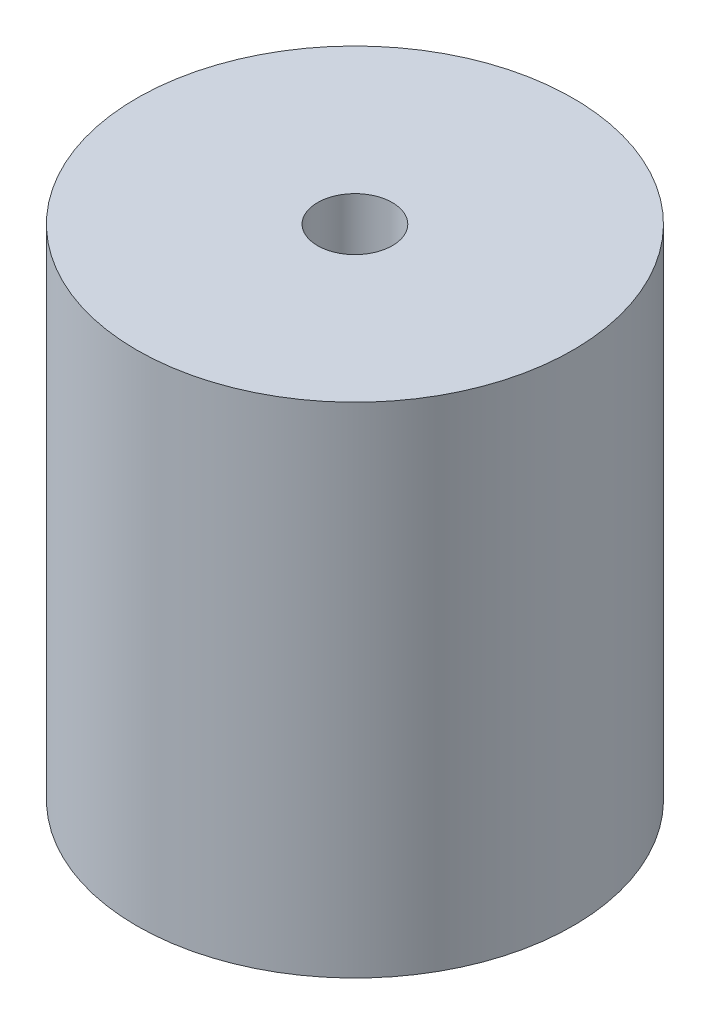
ISO-10303-21;
HEADER;
FILE_DESCRIPTION(('STEP AP214'),'2;1');
FILE_NAME('part.step','',(''),(''),'','','');
FILE_SCHEMA(('AUTOMOTIVE_DESIGN { 1 0 10303 214 1 1 1 1 }'));
ENDSEC;
DATA;
#1=APPLICATION_CONTEXT('core data for automotive mechanical design processes');
#2=APPLICATION_PROTOCOL_DEFINITION('international standard','automotive_design',2000,#1);
#3=PRODUCT_CONTEXT('',#1,'mechanical');
#4=PRODUCT('Part','Part','',(#3));
#5=PRODUCT_RELATED_PRODUCT_CATEGORY('part','',(#4));
#6=PRODUCT_DEFINITION_FORMATION('','',#4);
#7=PRODUCT_DEFINITION_CONTEXT('part definition',#1,'design');
#8=PRODUCT_DEFINITION('design','',#6,#7);
#9=PRODUCT_DEFINITION_SHAPE('','',#8);
#10=(LENGTH_UNIT() NAMED_UNIT(*) SI_UNIT(.MILLI.,.METRE.));
#11=(NAMED_UNIT(*) PLANE_ANGLE_UNIT() SI_UNIT($,.RADIAN.));
#12=(NAMED_UNIT(*) SI_UNIT($,.STERADIAN.) SOLID_ANGLE_UNIT());
#13=UNCERTAINTY_MEASURE_WITH_UNIT(LENGTH_MEASURE(1.E-05),#10,'distance_accuracy_value','');
#14=(GEOMETRIC_REPRESENTATION_CONTEXT(3) GLOBAL_UNCERTAINTY_ASSIGNED_CONTEXT((#13)) GLOBAL_UNIT_ASSIGNED_CONTEXT((#10,
#11,#12)) REPRESENTATION_CONTEXT('',''));
#15=CARTESIAN_POINT('',(0.,0.,0.));
#16=DIRECTION('',(0.,0.,1.));
#17=DIRECTION('',(1.,0.,0.));
#18=AXIS2_PLACEMENT_3D('',#15,#16,#17);
#19=CARTESIAN_POINT('',(0.,220.,0.));
#20=DIRECTION('',(0.,-1.,0.));
#21=DIRECTION('',(0.,0.,-1.));
#22=AXIS2_PLACEMENT_3D('',#19,#20,#21);
#23=CYLINDRICAL_SURFACE('',#22,17.5);
#24=CARTESIAN_POINT('',(0.,220.,0.));
#25=DIRECTION('',(0.,1.,0.));
#26=DIRECTION('',(0.,0.,1.));
#27=AXIS2_PLACEMENT_3D('',#24,#25,#26);
#28=CIRCLE('',#27,17.5);
#29=CARTESIAN_POINT('',(0.,220.,17.5));
#30=VERTEX_POINT('',#29);
#31=EDGE_CURVE('E10',#30,#30,#28,.T.);
#32=ORIENTED_EDGE('',*,*,#31,.F.);
#33=EDGE_LOOP('',(#32));
#34=FACE_BOUND('',#33,.T.);
#35=CARTESIAN_POINT('',(0.,180.,0.));
#36=DIRECTION('',(0.,1.,0.));
#37=DIRECTION('',(0.,0.,1.));
#38=AXIS2_PLACEMENT_3D('',#35,#36,#37);
#39=CIRCLE('',#38,17.5);
#40=CARTESIAN_POINT('',(0.,180.,17.5));
#41=VERTEX_POINT('',#40);
#42=EDGE_CURVE('E44',#41,#41,#39,.T.);
#43=ORIENTED_EDGE('',*,*,#42,.T.);
#44=EDGE_LOOP('',(#43));
#45=FACE_BOUND('',#44,.T.);
#46=ADVANCED_FACE('F41',(#34,#45),#23,.T.);
#47=CARTESIAN_POINT('',(0.,220.,0.));
#48=DIRECTION('',(0.,1.,0.));
#49=DIRECTION('',(0.,0.,1.));
#50=AXIS2_PLACEMENT_3D('',#47,#48,#49);
#51=PLANE('',#50);
#52=CARTESIAN_POINT('',(0.,220.,0.));
#53=DIRECTION('',(0.,1.,0.));
#54=DIRECTION('',(0.,0.,1.));
#55=AXIS2_PLACEMENT_3D('',#52,#53,#54);
#56=CIRCLE('',#55,3.);
#57=CARTESIAN_POINT('',(0.,220.,3.));
#58=VERTEX_POINT('',#57);
#59=EDGE_CURVE('E53',#58,#58,#56,.T.);
#60=ORIENTED_EDGE('',*,*,#59,.F.);
#61=EDGE_LOOP('',(#60));
#62=FACE_BOUND('',#61,.T.);
#63=ORIENTED_EDGE('',*,*,#31,.T.);
#64=EDGE_LOOP('',(#63));
#65=FACE_BOUND('',#64,.T.);
#66=ADVANCED_FACE('F68',(#62,#65),#51,.T.);
#67=CARTESIAN_POINT('',(0.,180.,0.));
#68=DIRECTION('',(0.,1.,0.));
#69=DIRECTION('',(0.,0.,1.));
#70=AXIS2_PLACEMENT_3D('',#67,#68,#69);
#71=PLANE('',#70);
#72=CARTESIAN_POINT('',(0.,180.,0.));
#73=DIRECTION('',(0.,1.,0.));
#74=DIRECTION('',(0.,0.,1.));
#75=AXIS2_PLACEMENT_3D('',#72,#73,#74);
#76=CIRCLE('',#75,3.);
#77=CARTESIAN_POINT('',(0.,180.,3.));
#78=VERTEX_POINT('',#77);
#79=EDGE_CURVE('E51',#78,#78,#76,.T.);
#80=ORIENTED_EDGE('',*,*,#79,.T.);
#81=EDGE_LOOP('',(#80));
#82=FACE_BOUND('',#81,.T.);
#83=ORIENTED_EDGE('',*,*,#42,.F.);
#84=EDGE_LOOP('',(#83));
#85=FACE_BOUND('',#84,.T.);
#86=ADVANCED_FACE('F59',(#82,#85),#71,.F.);
#87=CARTESIAN_POINT('',(0.,180.,0.));
#88=DIRECTION('',(0.,1.,0.));
#89=DIRECTION('',(0.,0.,1.));
#90=AXIS2_PLACEMENT_3D('',#87,#88,#89);
#91=CYLINDRICAL_SURFACE('',#90,3.);
#92=ORIENTED_EDGE('',*,*,#79,.F.);
#93=EDGE_LOOP('',(#92));
#94=FACE_BOUND('',#93,.T.);
#95=ORIENTED_EDGE('',*,*,#59,.T.);
#96=EDGE_LOOP('',(#95));
#97=FACE_BOUND('',#96,.T.);
#98=ADVANCED_FACE('F62',(#94,#97),#91,.F.);
#99=CLOSED_SHELL('',(#46,#66,#86,#98));
#100=MANIFOLD_SOLID_BREP('B2',#99);
#101=ADVANCED_BREP_SHAPE_REPRESENTATION('',(#18,#100),#14);
#102=SHAPE_DEFINITION_REPRESENTATION(#9,#101);
ENDSEC;
END-ISO-10303-21;
